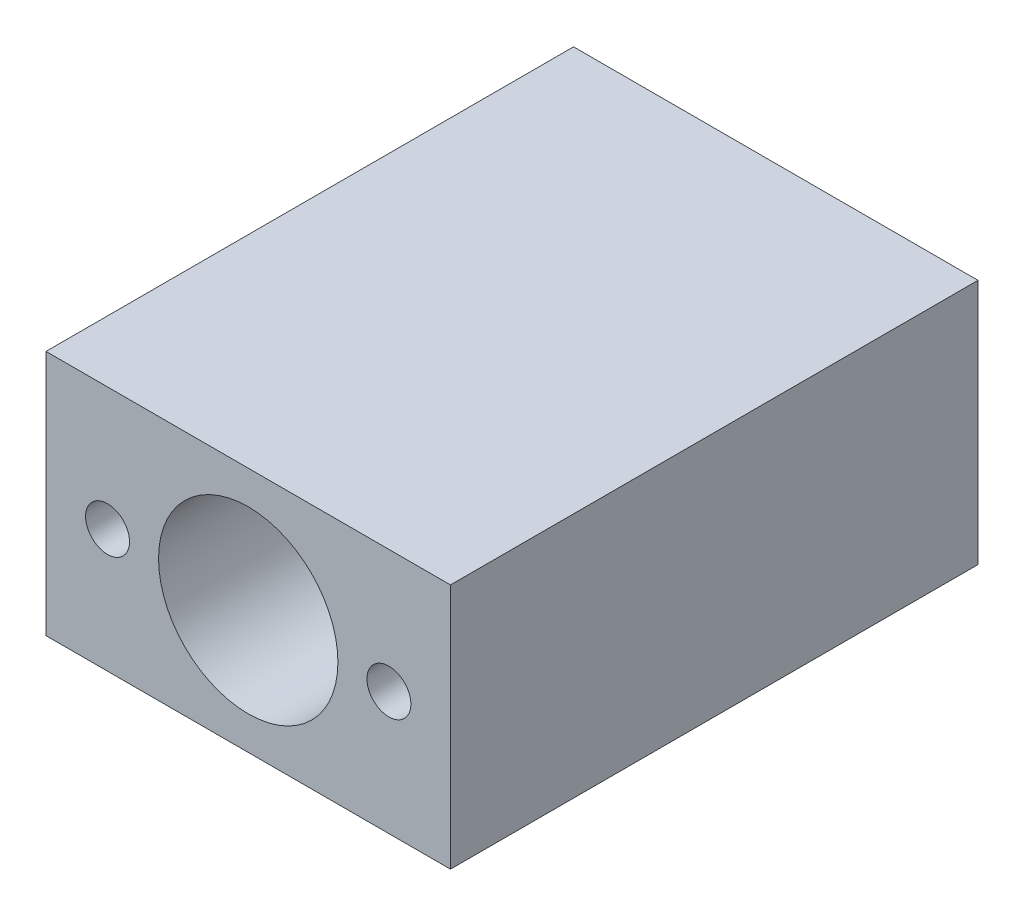
ISO-10303-21;
HEADER;
FILE_DESCRIPTION(('STEP AP214'),'2;1');
FILE_NAME('part.step','',(''),(''),'','','');
FILE_SCHEMA(('AUTOMOTIVE_DESIGN { 1 0 10303 214 1 1 1 1 }'));
ENDSEC;
DATA;
#1=APPLICATION_CONTEXT('core data for automotive mechanical design processes');
#2=APPLICATION_PROTOCOL_DEFINITION('international standard','automotive_design',2000,#1);
#3=PRODUCT_CONTEXT('',#1,'mechanical');
#4=PRODUCT('Part','Part','',(#3));
#5=PRODUCT_RELATED_PRODUCT_CATEGORY('part','',(#4));
#6=PRODUCT_DEFINITION_FORMATION('','',#4);
#7=PRODUCT_DEFINITION_CONTEXT('part definition',#1,'design');
#8=PRODUCT_DEFINITION('design','',#6,#7);
#9=PRODUCT_DEFINITION_SHAPE('','',#8);
#10=(LENGTH_UNIT() NAMED_UNIT(*) SI_UNIT(.MILLI.,.METRE.));
#11=(NAMED_UNIT(*) PLANE_ANGLE_UNIT() SI_UNIT($,.RADIAN.));
#12=(NAMED_UNIT(*) SI_UNIT($,.STERADIAN.) SOLID_ANGLE_UNIT());
#13=UNCERTAINTY_MEASURE_WITH_UNIT(LENGTH_MEASURE(1.E-05),#10,'distance_accuracy_value','');
#14=(GEOMETRIC_REPRESENTATION_CONTEXT(3) GLOBAL_UNCERTAINTY_ASSIGNED_CONTEXT((#13)) GLOBAL_UNIT_ASSIGNED_CONTEXT((#10,
#11,#12)) REPRESENTATION_CONTEXT('',''));
#15=CARTESIAN_POINT('',(0.,0.,0.));
#16=DIRECTION('',(0.,0.,1.));
#17=DIRECTION('',(1.,0.,0.));
#18=AXIS2_PLACEMENT_3D('',#15,#16,#17);
#19=CARTESIAN_POINT('',(0.,0.,30.));
#20=DIRECTION('',(0.,0.,-1.));
#21=DIRECTION('',(-1.,0.,0.));
#22=AXIS2_PLACEMENT_3D('',#19,#20,#21);
#23=PLANE('',#22);
#24=CARTESIAN_POINT('',(3.5,7.,30.));
#25=DIRECTION('',(0.,0.,1.));
#26=DIRECTION('',(1.,0.,0.));
#27=AXIS2_PLACEMENT_3D('',#24,#25,#26);
#28=CIRCLE('',#27,1.25);
#29=CARTESIAN_POINT('',(4.75,7.,30.));
#30=VERTEX_POINT('',#29);
#31=EDGE_CURVE('E110',#30,#30,#28,.T.);
#32=ORIENTED_EDGE('',*,*,#31,.F.);
#33=EDGE_LOOP('',(#32));
#34=FACE_BOUND('',#33,.T.);
#35=CARTESIAN_POINT('',(19.5,7.,30.));
#36=DIRECTION('',(0.,0.,1.));
#37=DIRECTION('',(1.,0.,0.));
#38=AXIS2_PLACEMENT_3D('',#35,#36,#37);
#39=CIRCLE('',#38,1.25);
#40=CARTESIAN_POINT('',(20.75,7.,30.));
#41=VERTEX_POINT('',#40);
#42=EDGE_CURVE('E109',#41,#41,#39,.T.);
#43=ORIENTED_EDGE('',*,*,#42,.F.);
#44=EDGE_LOOP('',(#43));
#45=FACE_BOUND('',#44,.T.);
#46=DIRECTION('',(0.,-1.,0.));
#47=VECTOR('',#46,1.);
#48=CARTESIAN_POINT('',(0.,0.,30.));
#49=LINE('',#48,#47);
#50=CARTESIAN_POINT('',(0.,14.,30.));
#51=VERTEX_POINT('',#50);
#52=CARTESIAN_POINT('',(0.,0.,30.));
#53=VERTEX_POINT('',#52);
#54=EDGE_CURVE('E127',#51,#53,#49,.T.);
#55=ORIENTED_EDGE('',*,*,#54,.T.);
#56=DIRECTION('',(1.,0.,0.));
#57=VECTOR('',#56,1.);
#58=CARTESIAN_POINT('',(0.,0.,30.));
#59=LINE('',#58,#57);
#60=CARTESIAN_POINT('',(23.,0.,30.));
#61=VERTEX_POINT('',#60);
#62=EDGE_CURVE('E92',#53,#61,#59,.T.);
#63=ORIENTED_EDGE('',*,*,#62,.T.);
#64=DIRECTION('',(0.,1.,0.));
#65=VECTOR('',#64,1.);
#66=CARTESIAN_POINT('',(23.,0.,30.));
#67=LINE('',#66,#65);
#68=CARTESIAN_POINT('',(23.,14.,30.));
#69=VERTEX_POINT('',#68);
#70=EDGE_CURVE('E130',#61,#69,#67,.T.);
#71=ORIENTED_EDGE('',*,*,#70,.T.);
#72=DIRECTION('',(-1.,0.,0.));
#73=VECTOR('',#72,1.);
#74=CARTESIAN_POINT('',(0.,14.,30.));
#75=LINE('',#74,#73);
#76=EDGE_CURVE('E61',#69,#51,#75,.T.);
#77=ORIENTED_EDGE('',*,*,#76,.T.);
#78=EDGE_LOOP('',(#55,#63,#71,#77));
#79=FACE_BOUND('',#78,.T.);
#80=CARTESIAN_POINT('',(11.5,7.,30.));
#81=DIRECTION('',(0.,0.,1.));
#82=DIRECTION('',(1.,0.,0.));
#83=AXIS2_PLACEMENT_3D('',#80,#81,#82);
#84=CIRCLE('',#83,5.1);
#85=CARTESIAN_POINT('',(16.6,7.,30.));
#86=VERTEX_POINT('',#85);
#87=EDGE_CURVE('E121',#86,#86,#84,.T.);
#88=ORIENTED_EDGE('',*,*,#87,.F.);
#89=EDGE_LOOP('',(#88));
#90=FACE_BOUND('',#89,.T.);
#91=ADVANCED_FACE('F44',(#34,#45,#79,#90),#23,.F.);
#92=CARTESIAN_POINT('',(0.,0.,0.));
#93=DIRECTION('',(0.,0.,-1.));
#94=DIRECTION('',(-1.,0.,0.));
#95=AXIS2_PLACEMENT_3D('',#92,#93,#94);
#96=PLANE('',#95);
#97=DIRECTION('',(0.,-1.,0.));
#98=VECTOR('',#97,1.);
#99=CARTESIAN_POINT('',(0.,0.,0.));
#100=LINE('',#99,#98);
#101=CARTESIAN_POINT('',(0.,14.,0.));
#102=VERTEX_POINT('',#101);
#103=CARTESIAN_POINT('',(0.,0.,0.));
#104=VERTEX_POINT('',#103);
#105=EDGE_CURVE('E124',#102,#104,#100,.T.);
#106=ORIENTED_EDGE('',*,*,#105,.F.);
#107=DIRECTION('',(-1.,0.,0.));
#108=VECTOR('',#107,1.);
#109=CARTESIAN_POINT('',(0.,14.,0.));
#110=LINE('',#109,#108);
#111=CARTESIAN_POINT('',(23.,14.,0.));
#112=VERTEX_POINT('',#111);
#113=EDGE_CURVE('E85',#112,#102,#110,.T.);
#114=ORIENTED_EDGE('',*,*,#113,.F.);
#115=DIRECTION('',(0.,1.,0.));
#116=VECTOR('',#115,1.);
#117=CARTESIAN_POINT('',(23.,0.,0.));
#118=LINE('',#117,#116);
#119=CARTESIAN_POINT('',(23.,0.,0.));
#120=VERTEX_POINT('',#119);
#121=EDGE_CURVE('E79',#120,#112,#118,.T.);
#122=ORIENTED_EDGE('',*,*,#121,.F.);
#123=DIRECTION('',(1.,0.,0.));
#124=VECTOR('',#123,1.);
#125=CARTESIAN_POINT('',(0.,0.,0.));
#126=LINE('',#125,#124);
#127=EDGE_CURVE('E136',#104,#120,#126,.T.);
#128=ORIENTED_EDGE('',*,*,#127,.F.);
#129=EDGE_LOOP('',(#106,#114,#122,#128));
#130=FACE_BOUND('',#129,.T.);
#131=CARTESIAN_POINT('',(11.5,7.,0.));
#132=DIRECTION('',(0.,0.,1.));
#133=DIRECTION('',(1.,0.,0.));
#134=AXIS2_PLACEMENT_3D('',#131,#132,#133);
#135=CIRCLE('',#134,5.1);
#136=CARTESIAN_POINT('',(16.6,7.,0.));
#137=VERTEX_POINT('',#136);
#138=EDGE_CURVE('E120',#137,#137,#135,.T.);
#139=ORIENTED_EDGE('',*,*,#138,.T.);
#140=EDGE_LOOP('',(#139));
#141=FACE_BOUND('',#140,.T.);
#142=ADVANCED_FACE('F146',(#130,#141),#96,.T.);
#143=CARTESIAN_POINT('',(0.,0.,30.));
#144=DIRECTION('',(1.,0.,0.));
#145=DIRECTION('',(0.,0.,-1.));
#146=AXIS2_PLACEMENT_3D('',#143,#144,#145);
#147=PLANE('',#146);
#148=ORIENTED_EDGE('',*,*,#105,.T.);
#149=DIRECTION('',(0.,0.,-1.));
#150=VECTOR('',#149,1.);
#151=CARTESIAN_POINT('',(0.,0.,30.));
#152=LINE('',#151,#150);
#153=EDGE_CURVE('E13',#53,#104,#152,.T.);
#154=ORIENTED_EDGE('',*,*,#153,.F.);
#155=ORIENTED_EDGE('',*,*,#54,.F.);
#156=DIRECTION('',(0.,0.,-1.));
#157=VECTOR('',#156,1.);
#158=CARTESIAN_POINT('',(0.,14.,30.));
#159=LINE('',#158,#157);
#160=EDGE_CURVE('E133',#51,#102,#159,.T.);
#161=ORIENTED_EDGE('',*,*,#160,.T.);
#162=EDGE_LOOP('',(#148,#154,#155,#161));
#163=FACE_BOUND('',#162,.T.);
#164=ADVANCED_FACE('F46',(#163),#147,.F.);
#165=CARTESIAN_POINT('',(0.,0.,30.));
#166=DIRECTION('',(0.,1.,0.));
#167=DIRECTION('',(0.,0.,1.));
#168=AXIS2_PLACEMENT_3D('',#165,#166,#167);
#169=PLANE('',#168);
#170=ORIENTED_EDGE('',*,*,#127,.T.);
#171=DIRECTION('',(0.,0.,-1.));
#172=VECTOR('',#171,1.);
#173=CARTESIAN_POINT('',(23.,0.,30.));
#174=LINE('',#173,#172);
#175=EDGE_CURVE('E53',#61,#120,#174,.T.);
#176=ORIENTED_EDGE('',*,*,#175,.F.);
#177=ORIENTED_EDGE('',*,*,#62,.F.);
#178=ORIENTED_EDGE('',*,*,#153,.T.);
#179=EDGE_LOOP('',(#170,#176,#177,#178));
#180=FACE_BOUND('',#179,.T.);
#181=ADVANCED_FACE('F162',(#180),#169,.F.);
#182=CARTESIAN_POINT('',(23.,0.,30.));
#183=DIRECTION('',(-1.,0.,0.));
#184=DIRECTION('',(0.,0.,1.));
#185=AXIS2_PLACEMENT_3D('',#182,#183,#184);
#186=PLANE('',#185);
#187=ORIENTED_EDGE('',*,*,#121,.T.);
#188=DIRECTION('',(0.,0.,-1.));
#189=VECTOR('',#188,1.);
#190=CARTESIAN_POINT('',(23.,14.,30.));
#191=LINE('',#190,#189);
#192=EDGE_CURVE('E141',#69,#112,#191,.T.);
#193=ORIENTED_EDGE('',*,*,#192,.F.);
#194=ORIENTED_EDGE('',*,*,#70,.F.);
#195=ORIENTED_EDGE('',*,*,#175,.T.);
#196=EDGE_LOOP('',(#187,#193,#194,#195));
#197=FACE_BOUND('',#196,.T.);
#198=ADVANCED_FACE('F143',(#197),#186,.F.);
#199=CARTESIAN_POINT('',(0.,14.,30.));
#200=DIRECTION('',(0.,-1.,0.));
#201=DIRECTION('',(0.,0.,-1.));
#202=AXIS2_PLACEMENT_3D('',#199,#200,#201);
#203=PLANE('',#202);
#204=ORIENTED_EDGE('',*,*,#113,.T.);
#205=ORIENTED_EDGE('',*,*,#160,.F.);
#206=ORIENTED_EDGE('',*,*,#76,.F.);
#207=ORIENTED_EDGE('',*,*,#192,.T.);
#208=EDGE_LOOP('',(#204,#205,#206,#207));
#209=FACE_BOUND('',#208,.T.);
#210=ADVANCED_FACE('F151',(#209),#203,.F.);
#211=CARTESIAN_POINT('',(11.5,7.,30.));
#212=DIRECTION('',(0.,0.,-1.));
#213=DIRECTION('',(-1.,0.,0.));
#214=AXIS2_PLACEMENT_3D('',#211,#212,#213);
#215=CYLINDRICAL_SURFACE('',#214,5.1);
#216=ORIENTED_EDGE('',*,*,#87,.T.);
#217=EDGE_LOOP('',(#216));
#218=FACE_BOUND('',#217,.T.);
#219=ORIENTED_EDGE('',*,*,#138,.F.);
#220=EDGE_LOOP('',(#219));
#221=FACE_BOUND('',#220,.T.);
#222=ADVANCED_FACE('F153',(#218,#221),#215,.F.);
#223=CARTESIAN_POINT('',(19.5,7.,18.));
#224=DIRECTION('',(0.,0.,1.));
#225=DIRECTION('',(1.,0.,0.));
#226=AXIS2_PLACEMENT_3D('',#223,#224,#225);
#227=CONICAL_SURFACE('',#226,1.25,1.02974425867665);
#228=CARTESIAN_POINT('',(19.5,7.,17.2489242262155));
#229=VERTEX_POINT('',#228);
#230=VERTEX_LOOP('',#229);
#231=FACE_BOUND('',#230,.T.);
#232=CARTESIAN_POINT('',(19.5,7.,18.));
#233=DIRECTION('',(0.,0.,1.));
#234=DIRECTION('',(1.,0.,0.));
#235=AXIS2_PLACEMENT_3D('',#232,#233,#234);
#236=CIRCLE('',#235,1.25);
#237=CARTESIAN_POINT('',(20.75,7.,18.));
#238=VERTEX_POINT('',#237);
#239=EDGE_CURVE('E113',#238,#238,#236,.T.);
#240=ORIENTED_EDGE('',*,*,#239,.T.);
#241=EDGE_LOOP('',(#240));
#242=FACE_BOUND('',#241,.T.);
#243=ADVANCED_FACE('F159',(#231,#242),#227,.F.);
#244=CARTESIAN_POINT('',(19.5,7.,30.));
#245=DIRECTION('',(0.,0.,1.));
#246=DIRECTION('',(1.,0.,0.));
#247=AXIS2_PLACEMENT_3D('',#244,#245,#246);
#248=CYLINDRICAL_SURFACE('',#247,1.25);
#249=ORIENTED_EDGE('',*,*,#239,.F.);
#250=EDGE_LOOP('',(#249));
#251=FACE_BOUND('',#250,.T.);
#252=ORIENTED_EDGE('',*,*,#42,.T.);
#253=EDGE_LOOP('',(#252));
#254=FACE_BOUND('',#253,.T.);
#255=ADVANCED_FACE('F103',(#251,#254),#248,.F.);
#256=CARTESIAN_POINT('',(3.5,7.,18.));
#257=DIRECTION('',(0.,0.,1.));
#258=DIRECTION('',(1.,0.,0.));
#259=AXIS2_PLACEMENT_3D('',#256,#257,#258);
#260=CONICAL_SURFACE('',#259,1.25,1.02974425867665);
#261=CARTESIAN_POINT('',(3.5,7.,17.2489242262155));
#262=VERTEX_POINT('',#261);
#263=VERTEX_LOOP('',#262);
#264=FACE_BOUND('',#263,.T.);
#265=CARTESIAN_POINT('',(3.5,7.,18.));
#266=DIRECTION('',(0.,0.,1.));
#267=DIRECTION('',(1.,0.,0.));
#268=AXIS2_PLACEMENT_3D('',#265,#266,#267);
#269=CIRCLE('',#268,1.25);
#270=CARTESIAN_POINT('',(4.75,7.,18.));
#271=VERTEX_POINT('',#270);
#272=EDGE_CURVE('E107',#271,#271,#269,.T.);
#273=ORIENTED_EDGE('',*,*,#272,.T.);
#274=EDGE_LOOP('',(#273));
#275=FACE_BOUND('',#274,.T.);
#276=ADVANCED_FACE('F99',(#264,#275),#260,.F.);
#277=CARTESIAN_POINT('',(3.5,7.,30.));
#278=DIRECTION('',(0.,0.,1.));
#279=DIRECTION('',(1.,0.,0.));
#280=AXIS2_PLACEMENT_3D('',#277,#278,#279);
#281=CYLINDRICAL_SURFACE('',#280,1.25);
#282=ORIENTED_EDGE('',*,*,#272,.F.);
#283=EDGE_LOOP('',(#282));
#284=FACE_BOUND('',#283,.T.);
#285=ORIENTED_EDGE('',*,*,#31,.T.);
#286=EDGE_LOOP('',(#285));
#287=FACE_BOUND('',#286,.T.);
#288=ADVANCED_FACE('F102',(#284,#287),#281,.F.);
#289=CLOSED_SHELL('',(#91,#142,#164,#181,#198,#210,#222,#243,#255,#276,#288));
#290=MANIFOLD_SOLID_BREP('B2',#289);
#291=ADVANCED_BREP_SHAPE_REPRESENTATION('',(#18,#290),#14);
#292=SHAPE_DEFINITION_REPRESENTATION(#9,#291);
ENDSEC;
END-ISO-10303-21;
